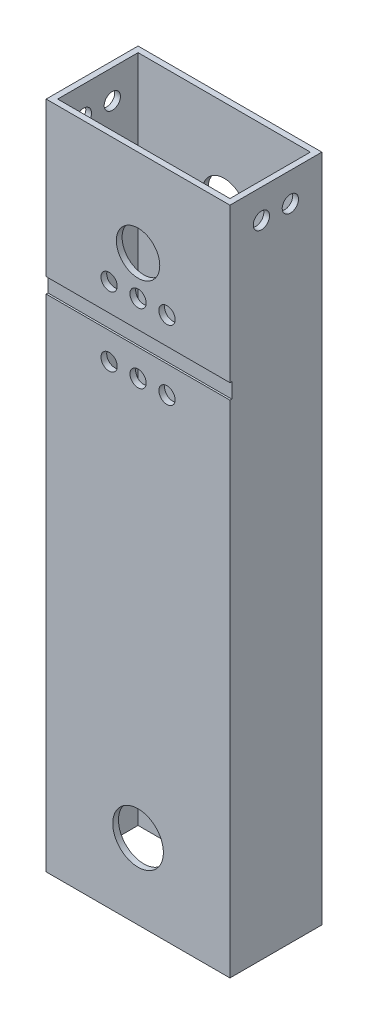
ISO-10303-21;
HEADER;
FILE_DESCRIPTION(('STEP AP214'),'2;1');
FILE_NAME('part.step','',(''),(''),'','','');
FILE_SCHEMA(('AUTOMOTIVE_DESIGN { 1 0 10303 214 1 1 1 1 }'));
ENDSEC;
DATA;
#1=APPLICATION_CONTEXT('core data for automotive mechanical design processes');
#2=APPLICATION_PROTOCOL_DEFINITION('international standard','automotive_design',2000,#1);
#3=PRODUCT_CONTEXT('',#1,'mechanical');
#4=PRODUCT('Part','Part','',(#3));
#5=PRODUCT_RELATED_PRODUCT_CATEGORY('part','',(#4));
#6=PRODUCT_DEFINITION_FORMATION('','',#4);
#7=PRODUCT_DEFINITION_CONTEXT('part definition',#1,'design');
#8=PRODUCT_DEFINITION('design','',#6,#7);
#9=PRODUCT_DEFINITION_SHAPE('','',#8);
#10=(LENGTH_UNIT() NAMED_UNIT(*) SI_UNIT(.MILLI.,.METRE.));
#11=(NAMED_UNIT(*) PLANE_ANGLE_UNIT() SI_UNIT($,.RADIAN.));
#12=(NAMED_UNIT(*) SI_UNIT($,.STERADIAN.) SOLID_ANGLE_UNIT());
#13=UNCERTAINTY_MEASURE_WITH_UNIT(LENGTH_MEASURE(1.E-05),#10,'distance_accuracy_value','');
#14=(GEOMETRIC_REPRESENTATION_CONTEXT(3) GLOBAL_UNCERTAINTY_ASSIGNED_CONTEXT((#13)) GLOBAL_UNIT_ASSIGNED_CONTEXT((#10,
#11,#12)) REPRESENTATION_CONTEXT('',''));
#15=CARTESIAN_POINT('',(0.,0.,0.));
#16=DIRECTION('',(0.,0.,1.));
#17=DIRECTION('',(1.,0.,0.));
#18=AXIS2_PLACEMENT_3D('',#15,#16,#17);
#19=CARTESIAN_POINT('',(25.3999999999999,-20.,-41.));
#20=DIRECTION('',(0.,0.,1.));
#21=DIRECTION('',(1.,0.,0.));
#22=AXIS2_PLACEMENT_3D('',#19,#20,#21);
#23=PLANE('',#22);
#24=DIRECTION('',(-1.,0.,0.));
#25=VECTOR('',#24,1.);
#26=CARTESIAN_POINT('',(-25.4,121.675,-41.));
#27=LINE('',#26,#25);
#28=CARTESIAN_POINT('',(25.4,121.675,-41.));
#29=VERTEX_POINT('',#28);
#30=CARTESIAN_POINT('',(-25.4,121.675,-41.));
#31=VERTEX_POINT('',#30);
#32=EDGE_CURVE('E194',#29,#31,#27,.T.);
#33=ORIENTED_EDGE('',*,*,#32,.F.);
#34=DIRECTION('',(0.,1.,0.));
#35=VECTOR('',#34,1.);
#36=CARTESIAN_POINT('',(25.3999999999999,-20.,-41.));
#37=LINE('',#36,#35);
#38=CARTESIAN_POINT('',(25.3999999999999,164.175,-41.));
#39=VERTEX_POINT('',#38);
#40=EDGE_CURVE('E48',#29,#39,#37,.T.);
#41=ORIENTED_EDGE('',*,*,#40,.T.);
#42=DIRECTION('',(1.,0.,0.));
#43=VECTOR('',#42,1.);
#44=CARTESIAN_POINT('',(25.3999999999999,164.175,-41.));
#45=LINE('',#44,#43);
#46=CARTESIAN_POINT('',(-25.3999999999999,164.175,-41.));
#47=VERTEX_POINT('',#46);
#48=EDGE_CURVE('E300',#47,#39,#45,.T.);
#49=ORIENTED_EDGE('',*,*,#48,.F.);
#50=DIRECTION('',(0.,1.,0.));
#51=VECTOR('',#50,1.);
#52=CARTESIAN_POINT('',(-25.3999999999999,-20.,-41.));
#53=LINE('',#52,#51);
#54=EDGE_CURVE('E311',#31,#47,#53,.T.);
#55=ORIENTED_EDGE('',*,*,#54,.F.);
#56=EDGE_LOOP('',(#33,#41,#49,#55));
#57=FACE_BOUND('',#56,.T.);
#58=CARTESIAN_POINT('',(7.99999999999999,129.175,-41.));
#59=DIRECTION('',(0.,0.,1.));
#60=DIRECTION('',(1.,0.,0.));
#61=AXIS2_PLACEMENT_3D('',#58,#59,#60);
#62=CIRCLE('',#61,2.25);
#63=CARTESIAN_POINT('',(10.25,129.175,-41.));
#64=VERTEX_POINT('',#63);
#65=EDGE_CURVE('E216',#64,#64,#62,.T.);
#66=ORIENTED_EDGE('',*,*,#65,.F.);
#67=EDGE_LOOP('',(#66));
#68=FACE_BOUND('',#67,.T.);
#69=CARTESIAN_POINT('',(0.,129.175,-41.));
#70=DIRECTION('',(0.,0.,1.));
#71=DIRECTION('',(1.,0.,0.));
#72=AXIS2_PLACEMENT_3D('',#69,#70,#71);
#73=CIRCLE('',#72,2.25);
#74=CARTESIAN_POINT('',(2.24999999999999,129.175,-41.));
#75=VERTEX_POINT('',#74);
#76=EDGE_CURVE('E213',#75,#75,#73,.T.);
#77=ORIENTED_EDGE('',*,*,#76,.F.);
#78=EDGE_LOOP('',(#77));
#79=FACE_BOUND('',#78,.T.);
#80=CARTESIAN_POINT('',(-8.00000000000001,129.175,-41.));
#81=DIRECTION('',(0.,0.,1.));
#82=DIRECTION('',(1.,0.,0.));
#83=AXIS2_PLACEMENT_3D('',#80,#81,#82);
#84=CIRCLE('',#83,2.25);
#85=CARTESIAN_POINT('',(-5.75000000000001,129.175,-41.));
#86=VERTEX_POINT('',#85);
#87=EDGE_CURVE('E217',#86,#86,#84,.T.);
#88=ORIENTED_EDGE('',*,*,#87,.F.);
#89=EDGE_LOOP('',(#88));
#90=FACE_BOUND('',#89,.T.);
#91=CARTESIAN_POINT('',(0.,140.,-41.));
#92=DIRECTION('',(0.,0.,1.));
#93=DIRECTION('',(1.,0.,0.));
#94=AXIS2_PLACEMENT_3D('',#91,#92,#93);
#95=CIRCLE('',#94,6.00000000000001);
#96=CARTESIAN_POINT('',(6.,140.,-41.));
#97=VERTEX_POINT('',#96);
#98=EDGE_CURVE('E206',#97,#97,#95,.T.);
#99=ORIENTED_EDGE('',*,*,#98,.F.);
#100=EDGE_LOOP('',(#99));
#101=FACE_BOUND('',#100,.T.);
#102=ADVANCED_FACE('F39',(#57,#68,#79,#90,#101),#23,.T.);
#103=CARTESIAN_POINT('',(25.3999999999999,-20.,-66.4));
#104=DIRECTION('',(1.,0.,0.));
#105=DIRECTION('',(0.,0.,-1.));
#106=AXIS2_PLACEMENT_3D('',#103,#104,#105);
#107=PLANE('',#106);
#108=CARTESIAN_POINT('',(25.3999999999999,156.175,-57.7));
#109=DIRECTION('',(1.,0.,0.));
#110=DIRECTION('',(0.,0.,-1.));
#111=AXIS2_PLACEMENT_3D('',#108,#109,#110);
#112=CIRCLE('',#111,2.25);
#113=CARTESIAN_POINT('',(25.3999999999999,156.175,-59.95));
#114=VERTEX_POINT('',#113);
#115=EDGE_CURVE('E171',#114,#114,#112,.T.);
#116=ORIENTED_EDGE('',*,*,#115,.F.);
#117=EDGE_LOOP('',(#116));
#118=FACE_BOUND('',#117,.T.);
#119=CARTESIAN_POINT('',(25.3999999999999,156.175,-49.7));
#120=DIRECTION('',(1.,0.,0.));
#121=DIRECTION('',(0.,0.,-1.));
#122=AXIS2_PLACEMENT_3D('',#119,#120,#121);
#123=CIRCLE('',#122,2.25);
#124=CARTESIAN_POINT('',(25.3999999999999,156.175,-51.95));
#125=VERTEX_POINT('',#124);
#126=EDGE_CURVE('E170',#125,#125,#123,.T.);
#127=ORIENTED_EDGE('',*,*,#126,.F.);
#128=EDGE_LOOP('',(#127));
#129=FACE_BOUND('',#128,.T.);
#130=DIRECTION('',(0.,0.,1.));
#131=VECTOR('',#130,1.);
#132=CARTESIAN_POINT('',(25.4,121.675,-41.5));
#133=LINE('',#132,#131);
#134=CARTESIAN_POINT('',(25.4,121.675,-41.5));
#135=VERTEX_POINT('',#134);
#136=EDGE_CURVE('E207',#135,#29,#133,.T.);
#137=ORIENTED_EDGE('',*,*,#136,.F.);
#138=DIRECTION('',(0.,1.,0.));
#139=VECTOR('',#138,1.);
#140=CARTESIAN_POINT('',(25.4,121.675,-41.5));
#141=LINE('',#140,#139);
#142=CARTESIAN_POINT('',(25.4,117.5,-41.5));
#143=VERTEX_POINT('',#142);
#144=EDGE_CURVE('E197',#143,#135,#141,.T.);
#145=ORIENTED_EDGE('',*,*,#144,.F.);
#146=DIRECTION('',(0.,0.,1.));
#147=VECTOR('',#146,1.);
#148=CARTESIAN_POINT('',(25.4,117.5,-41.5));
#149=LINE('',#148,#147);
#150=CARTESIAN_POINT('',(25.4,117.5,-41.));
#151=VERTEX_POINT('',#150);
#152=EDGE_CURVE('E209',#143,#151,#149,.T.);
#153=ORIENTED_EDGE('',*,*,#152,.T.);
#154=CARTESIAN_POINT('',(25.3999999999999,-20.82,-41.));
#155=VERTEX_POINT('',#154);
#156=EDGE_CURVE('E11',#155,#151,#37,.T.);
#157=ORIENTED_EDGE('',*,*,#156,.F.);
#158=DIRECTION('',(0.,0.,1.));
#159=VECTOR('',#158,1.);
#160=CARTESIAN_POINT('',(25.3999999999999,-20.82,-66.4));
#161=LINE('',#160,#159);
#162=CARTESIAN_POINT('',(25.3999999999999,-20.82,-66.4));
#163=VERTEX_POINT('',#162);
#164=EDGE_CURVE('E161',#163,#155,#161,.T.);
#165=ORIENTED_EDGE('',*,*,#164,.F.);
#166=DIRECTION('',(0.,1.,0.));
#167=VECTOR('',#166,1.);
#168=CARTESIAN_POINT('',(25.3999999999999,-20.,-66.4));
#169=LINE('',#168,#167);
#170=CARTESIAN_POINT('',(25.3999999999999,164.175,-66.4));
#171=VERTEX_POINT('',#170);
#172=EDGE_CURVE('E304',#163,#171,#169,.T.);
#173=ORIENTED_EDGE('',*,*,#172,.T.);
#174=DIRECTION('',(0.,0.,-1.));
#175=VECTOR('',#174,1.);
#176=CARTESIAN_POINT('',(25.3999999999999,164.175,-66.4));
#177=LINE('',#176,#175);
#178=EDGE_CURVE('E291',#39,#171,#177,.T.);
#179=ORIENTED_EDGE('',*,*,#178,.F.);
#180=ORIENTED_EDGE('',*,*,#40,.F.);
#181=EDGE_LOOP('',(#137,#145,#153,#157,#165,#173,#179,#180));
#182=FACE_BOUND('',#181,.T.);
#183=ADVANCED_FACE('F41',(#118,#129,#182),#107,.T.);
#184=CARTESIAN_POINT('',(0.,0.,-41.));
#185=DIRECTION('',(0.,0.,1.));
#186=DIRECTION('',(1.,0.,0.));
#187=AXIS2_PLACEMENT_3D('',#184,#185,#186);
#188=CIRCLE('',#187,7.);
#189=CARTESIAN_POINT('',(7.,0.,-41.));
#190=VERTEX_POINT('',#189);
#191=EDGE_CURVE('E380',#190,#190,#188,.T.);
#192=ORIENTED_EDGE('',*,*,#191,.F.);
#193=EDGE_LOOP('',(#192));
#194=FACE_BOUND('',#193,.T.);
#195=DIRECTION('',(1.,0.,0.));
#196=VECTOR('',#195,1.);
#197=CARTESIAN_POINT('',(-25.4,117.5,-41.));
#198=LINE('',#197,#196);
#199=CARTESIAN_POINT('',(-25.4,117.5,-41.));
#200=VERTEX_POINT('',#199);
#201=EDGE_CURVE('E190',#200,#151,#198,.T.);
#202=ORIENTED_EDGE('',*,*,#201,.F.);
#203=CARTESIAN_POINT('',(-25.3999999999999,-20.82,-41.));
#204=VERTEX_POINT('',#203);
#205=EDGE_CURVE('E308',#204,#200,#53,.T.);
#206=ORIENTED_EDGE('',*,*,#205,.F.);
#207=DIRECTION('',(-1.,0.,0.));
#208=VECTOR('',#207,1.);
#209=CARTESIAN_POINT('',(25.3999999999999,-20.82,-41.));
#210=LINE('',#209,#208);
#211=EDGE_CURVE('E164',#155,#204,#210,.T.);
#212=ORIENTED_EDGE('',*,*,#211,.F.);
#213=ORIENTED_EDGE('',*,*,#156,.T.);
#214=EDGE_LOOP('',(#202,#206,#212,#213));
#215=FACE_BOUND('',#214,.T.);
#216=CARTESIAN_POINT('',(7.99999999999999,110.,-41.));
#217=DIRECTION('',(0.,0.,1.));
#218=DIRECTION('',(1.,0.,0.));
#219=AXIS2_PLACEMENT_3D('',#216,#217,#218);
#220=CIRCLE('',#219,2.25);
#221=CARTESIAN_POINT('',(10.25,110.,-41.));
#222=VERTEX_POINT('',#221);
#223=EDGE_CURVE('E229',#222,#222,#220,.T.);
#224=ORIENTED_EDGE('',*,*,#223,.F.);
#225=EDGE_LOOP('',(#224));
#226=FACE_BOUND('',#225,.T.);
#227=CARTESIAN_POINT('',(0.,110.,-41.));
#228=DIRECTION('',(0.,0.,1.));
#229=DIRECTION('',(1.,0.,0.));
#230=AXIS2_PLACEMENT_3D('',#227,#228,#229);
#231=CIRCLE('',#230,2.25);
#232=CARTESIAN_POINT('',(2.24999999999999,110.,-41.));
#233=VERTEX_POINT('',#232);
#234=EDGE_CURVE('E226',#233,#233,#231,.T.);
#235=ORIENTED_EDGE('',*,*,#234,.F.);
#236=EDGE_LOOP('',(#235));
#237=FACE_BOUND('',#236,.T.);
#238=CARTESIAN_POINT('',(-8.00000000000001,110.,-41.));
#239=DIRECTION('',(0.,0.,1.));
#240=DIRECTION('',(1.,0.,0.));
#241=AXIS2_PLACEMENT_3D('',#238,#239,#240);
#242=CIRCLE('',#241,2.25);
#243=CARTESIAN_POINT('',(-5.75000000000001,110.,-41.));
#244=VERTEX_POINT('',#243);
#245=EDGE_CURVE('E222',#244,#244,#242,.T.);
#246=ORIENTED_EDGE('',*,*,#245,.F.);
#247=EDGE_LOOP('',(#246));
#248=FACE_BOUND('',#247,.T.);
#249=ADVANCED_FACE('F356',(#194,#215,#226,#237,#248),#23,.T.);
#250=CARTESIAN_POINT('',(-25.3999999999999,-20.,-66.4));
#251=DIRECTION('',(-1.,0.,0.));
#252=DIRECTION('',(0.,0.,1.));
#253=AXIS2_PLACEMENT_3D('',#250,#251,#252);
#254=PLANE('',#253);
#255=CARTESIAN_POINT('',(-25.3999999999999,156.175,-57.7));
#256=DIRECTION('',(-1.,0.,0.));
#257=DIRECTION('',(0.,0.,1.));
#258=AXIS2_PLACEMENT_3D('',#255,#256,#257);
#259=CIRCLE('',#258,2.25);
#260=CARTESIAN_POINT('',(-25.3999999999999,156.175,-55.45));
#261=VERTEX_POINT('',#260);
#262=EDGE_CURVE('E187',#261,#261,#259,.T.);
#263=ORIENTED_EDGE('',*,*,#262,.F.);
#264=EDGE_LOOP('',(#263));
#265=FACE_BOUND('',#264,.T.);
#266=CARTESIAN_POINT('',(-25.3999999999999,156.175,-49.7));
#267=DIRECTION('',(-1.,0.,0.));
#268=DIRECTION('',(0.,0.,1.));
#269=AXIS2_PLACEMENT_3D('',#266,#267,#268);
#270=CIRCLE('',#269,2.25);
#271=CARTESIAN_POINT('',(-25.3999999999999,156.175,-47.45));
#272=VERTEX_POINT('',#271);
#273=EDGE_CURVE('E180',#272,#272,#270,.T.);
#274=ORIENTED_EDGE('',*,*,#273,.F.);
#275=EDGE_LOOP('',(#274));
#276=FACE_BOUND('',#275,.T.);
#277=DIRECTION('',(0.,0.,1.));
#278=VECTOR('',#277,1.);
#279=CARTESIAN_POINT('',(-25.4,121.675,-41.5));
#280=LINE('',#279,#278);
#281=CARTESIAN_POINT('',(-25.3999999999999,121.675,-41.5));
#282=VERTEX_POINT('',#281);
#283=EDGE_CURVE('E203',#282,#31,#280,.T.);
#284=ORIENTED_EDGE('',*,*,#283,.T.);
#285=ORIENTED_EDGE('',*,*,#54,.T.);
#286=DIRECTION('',(0.,0.,1.));
#287=VECTOR('',#286,1.);
#288=CARTESIAN_POINT('',(-25.3999999999999,164.175,-66.4));
#289=LINE('',#288,#287);
#290=CARTESIAN_POINT('',(-25.3999999999999,164.175,-66.4));
#291=VERTEX_POINT('',#290);
#292=EDGE_CURVE('E297',#291,#47,#289,.T.);
#293=ORIENTED_EDGE('',*,*,#292,.F.);
#294=DIRECTION('',(0.,1.,0.));
#295=VECTOR('',#294,1.);
#296=CARTESIAN_POINT('',(-25.3999999999999,-20.,-66.4));
#297=LINE('',#296,#295);
#298=CARTESIAN_POINT('',(-25.3999999999999,-20.82,-66.4));
#299=VERTEX_POINT('',#298);
#300=EDGE_CURVE('E312',#299,#291,#297,.T.);
#301=ORIENTED_EDGE('',*,*,#300,.F.);
#302=DIRECTION('',(0.,0.,-1.));
#303=VECTOR('',#302,1.);
#304=CARTESIAN_POINT('',(-25.3999999999999,-20.82,-41.));
#305=LINE('',#304,#303);
#306=EDGE_CURVE('E167',#204,#299,#305,.T.);
#307=ORIENTED_EDGE('',*,*,#306,.F.);
#308=ORIENTED_EDGE('',*,*,#205,.T.);
#309=DIRECTION('',(0.,0.,1.));
#310=VECTOR('',#309,1.);
#311=CARTESIAN_POINT('',(-25.4,117.5,-41.5));
#312=LINE('',#311,#310);
#313=CARTESIAN_POINT('',(-25.4,117.5,-41.5));
#314=VERTEX_POINT('',#313);
#315=EDGE_CURVE('E200',#314,#200,#312,.T.);
#316=ORIENTED_EDGE('',*,*,#315,.F.);
#317=DIRECTION('',(0.,-1.,0.));
#318=VECTOR('',#317,1.);
#319=CARTESIAN_POINT('',(-25.4,121.675,-41.5));
#320=LINE('',#319,#318);
#321=EDGE_CURVE('E191',#282,#314,#320,.T.);
#322=ORIENTED_EDGE('',*,*,#321,.F.);
#323=EDGE_LOOP('',(#284,#285,#293,#301,#307,#308,#316,#322));
#324=FACE_BOUND('',#323,.T.);
#325=ADVANCED_FACE('F368',(#265,#276,#324),#254,.T.);
#326=CARTESIAN_POINT('',(25.3999999999999,-20.,-66.4));
#327=DIRECTION('',(0.,0.,-1.));
#328=DIRECTION('',(-1.,0.,0.));
#329=AXIS2_PLACEMENT_3D('',#326,#327,#328);
#330=PLANE('',#329);
#331=CARTESIAN_POINT('',(0.,0.,-66.4));
#332=DIRECTION('',(0.,0.,-1.));
#333=DIRECTION('',(-1.,0.,0.));
#334=AXIS2_PLACEMENT_3D('',#331,#332,#333);
#335=CIRCLE('',#334,7.);
#336=CARTESIAN_POINT('',(-7.,0.,-66.4));
#337=VERTEX_POINT('',#336);
#338=EDGE_CURVE('E147',#337,#337,#335,.T.);
#339=ORIENTED_EDGE('',*,*,#338,.F.);
#340=EDGE_LOOP('',(#339));
#341=FACE_BOUND('',#340,.T.);
#342=CARTESIAN_POINT('',(0.,140.,-66.4));
#343=DIRECTION('',(0.,0.,-1.));
#344=DIRECTION('',(-1.,0.,0.));
#345=AXIS2_PLACEMENT_3D('',#342,#343,#344);
#346=CIRCLE('',#345,6.00000000000001);
#347=CARTESIAN_POINT('',(-6.00000000000002,140.,-66.4));
#348=VERTEX_POINT('',#347);
#349=EDGE_CURVE('E279',#348,#348,#346,.T.);
#350=ORIENTED_EDGE('',*,*,#349,.F.);
#351=EDGE_LOOP('',(#350));
#352=FACE_BOUND('',#351,.T.);
#353=CARTESIAN_POINT('',(-8.00000000000001,129.175,-66.4));
#354=DIRECTION('',(0.,0.,-1.));
#355=DIRECTION('',(-1.,0.,0.));
#356=AXIS2_PLACEMENT_3D('',#353,#354,#355);
#357=CIRCLE('',#356,2.25);
#358=CARTESIAN_POINT('',(-10.25,129.175,-66.4));
#359=VERTEX_POINT('',#358);
#360=EDGE_CURVE('E272',#359,#359,#357,.T.);
#361=ORIENTED_EDGE('',*,*,#360,.F.);
#362=EDGE_LOOP('',(#361));
#363=FACE_BOUND('',#362,.T.);
#364=CARTESIAN_POINT('',(0.,129.175,-66.4));
#365=DIRECTION('',(0.,0.,-1.));
#366=DIRECTION('',(-1.,0.,0.));
#367=AXIS2_PLACEMENT_3D('',#364,#365,#366);
#368=CIRCLE('',#367,2.25);
#369=CARTESIAN_POINT('',(-2.25000000000001,129.175,-66.4));
#370=VERTEX_POINT('',#369);
#371=EDGE_CURVE('E265',#370,#370,#368,.T.);
#372=ORIENTED_EDGE('',*,*,#371,.F.);
#373=EDGE_LOOP('',(#372));
#374=FACE_BOUND('',#373,.T.);
#375=CARTESIAN_POINT('',(7.99999999999999,129.175,-66.4));
#376=DIRECTION('',(0.,0.,-1.));
#377=DIRECTION('',(-1.,0.,0.));
#378=AXIS2_PLACEMENT_3D('',#375,#376,#377);
#379=CIRCLE('',#378,2.25);
#380=CARTESIAN_POINT('',(5.74999999999999,129.175,-66.4));
#381=VERTEX_POINT('',#380);
#382=EDGE_CURVE('E258',#381,#381,#379,.T.);
#383=ORIENTED_EDGE('',*,*,#382,.F.);
#384=EDGE_LOOP('',(#383));
#385=FACE_BOUND('',#384,.T.);
#386=CARTESIAN_POINT('',(7.99999999999999,110.,-66.4));
#387=DIRECTION('',(0.,0.,-1.));
#388=DIRECTION('',(-1.,0.,0.));
#389=AXIS2_PLACEMENT_3D('',#386,#387,#388);
#390=CIRCLE('',#389,2.25);
#391=CARTESIAN_POINT('',(5.74999999999999,110.,-66.4));
#392=VERTEX_POINT('',#391);
#393=EDGE_CURVE('E251',#392,#392,#390,.T.);
#394=ORIENTED_EDGE('',*,*,#393,.F.);
#395=EDGE_LOOP('',(#394));
#396=FACE_BOUND('',#395,.T.);
#397=CARTESIAN_POINT('',(0.,110.,-66.4));
#398=DIRECTION('',(0.,0.,-1.));
#399=DIRECTION('',(-1.,0.,0.));
#400=AXIS2_PLACEMENT_3D('',#397,#398,#399);
#401=CIRCLE('',#400,2.25);
#402=CARTESIAN_POINT('',(-2.25000000000001,110.,-66.4));
#403=VERTEX_POINT('',#402);
#404=EDGE_CURVE('E244',#403,#403,#401,.T.);
#405=ORIENTED_EDGE('',*,*,#404,.F.);
#406=EDGE_LOOP('',(#405));
#407=FACE_BOUND('',#406,.T.);
#408=CARTESIAN_POINT('',(-8.00000000000001,110.,-66.4));
#409=DIRECTION('',(0.,0.,-1.));
#410=DIRECTION('',(-1.,0.,0.));
#411=AXIS2_PLACEMENT_3D('',#408,#409,#410);
#412=CIRCLE('',#411,2.25);
#413=CARTESIAN_POINT('',(-10.25,110.,-66.4));
#414=VERTEX_POINT('',#413);
#415=EDGE_CURVE('E237',#414,#414,#412,.T.);
#416=ORIENTED_EDGE('',*,*,#415,.F.);
#417=EDGE_LOOP('',(#416));
#418=FACE_BOUND('',#417,.T.);
#419=ORIENTED_EDGE('',*,*,#300,.T.);
#420=DIRECTION('',(-1.,0.,0.));
#421=VECTOR('',#420,1.);
#422=CARTESIAN_POINT('',(25.3999999999999,164.175,-66.4));
#423=LINE('',#422,#421);
#424=EDGE_CURVE('E294',#171,#291,#423,.T.);
#425=ORIENTED_EDGE('',*,*,#424,.F.);
#426=ORIENTED_EDGE('',*,*,#172,.F.);
#427=DIRECTION('',(1.,0.,0.));
#428=VECTOR('',#427,1.);
#429=CARTESIAN_POINT('',(-25.3999999999999,-20.82,-66.4));
#430=LINE('',#429,#428);
#431=EDGE_CURVE('E158',#299,#163,#430,.T.);
#432=ORIENTED_EDGE('',*,*,#431,.F.);
#433=EDGE_LOOP('',(#419,#425,#426,#432));
#434=FACE_BOUND('',#433,.T.);
#435=ADVANCED_FACE('F375',(#341,#352,#363,#374,#385,#396,#407,#418,#434),#330,.T.);
#436=CARTESIAN_POINT('',(23.8125,-20.,-64.8125));
#437=DIRECTION('',(1.,0.,0.));
#438=DIRECTION('',(0.,0.,-1.));
#439=AXIS2_PLACEMENT_3D('',#436,#437,#438);
#440=PLANE('',#439);
#441=CARTESIAN_POINT('',(23.8125,156.175,-57.7));
#442=DIRECTION('',(1.,0.,0.));
#443=DIRECTION('',(0.,0.,-1.));
#444=AXIS2_PLACEMENT_3D('',#441,#442,#443);
#445=CIRCLE('',#444,2.25);
#446=CARTESIAN_POINT('',(23.8125,156.175,-59.95));
#447=VERTEX_POINT('',#446);
#448=EDGE_CURVE('E184',#447,#447,#445,.T.);
#449=ORIENTED_EDGE('',*,*,#448,.T.);
#450=EDGE_LOOP('',(#449));
#451=FACE_BOUND('',#450,.T.);
#452=CARTESIAN_POINT('',(23.8125,156.175,-49.7));
#453=DIRECTION('',(1.,0.,0.));
#454=DIRECTION('',(0.,0.,-1.));
#455=AXIS2_PLACEMENT_3D('',#452,#453,#454);
#456=CIRCLE('',#455,2.25);
#457=CARTESIAN_POINT('',(23.8125,156.175,-51.95));
#458=VERTEX_POINT('',#457);
#459=EDGE_CURVE('E177',#458,#458,#456,.T.);
#460=ORIENTED_EDGE('',*,*,#459,.T.);
#461=EDGE_LOOP('',(#460));
#462=FACE_BOUND('',#461,.T.);
#463=DIRECTION('',(0.,1.,0.));
#464=VECTOR('',#463,1.);
#465=CARTESIAN_POINT('',(23.8125,-20.,-42.5875));
#466=LINE('',#465,#464);
#467=CARTESIAN_POINT('',(23.8125,-20.82,-42.5875));
#468=VERTEX_POINT('',#467);
#469=CARTESIAN_POINT('',(23.8125,164.175,-42.5875));
#470=VERTEX_POINT('',#469);
#471=EDGE_CURVE('E138',#468,#470,#466,.T.);
#472=ORIENTED_EDGE('',*,*,#471,.T.);
#473=DIRECTION('',(0.,0.,-1.));
#474=VECTOR('',#473,1.);
#475=CARTESIAN_POINT('',(23.8125,164.175,-64.8125));
#476=LINE('',#475,#474);
#477=CARTESIAN_POINT('',(23.8125,164.175,-64.8125));
#478=VERTEX_POINT('',#477);
#479=EDGE_CURVE('E282',#470,#478,#476,.T.);
#480=ORIENTED_EDGE('',*,*,#479,.T.);
#481=DIRECTION('',(0.,1.,0.));
#482=VECTOR('',#481,1.);
#483=CARTESIAN_POINT('',(23.8125,-20.,-64.8125));
#484=LINE('',#483,#482);
#485=CARTESIAN_POINT('',(23.8125,-20.82,-64.8125));
#486=VERTEX_POINT('',#485);
#487=EDGE_CURVE('E303',#486,#478,#484,.T.);
#488=ORIENTED_EDGE('',*,*,#487,.F.);
#489=DIRECTION('',(0.,0.,1.));
#490=VECTOR('',#489,1.);
#491=CARTESIAN_POINT('',(23.8125,-20.82,-42.5875));
#492=LINE('',#491,#490);
#493=EDGE_CURVE('E153',#486,#468,#492,.T.);
#494=ORIENTED_EDGE('',*,*,#493,.T.);
#495=EDGE_LOOP('',(#472,#480,#488,#494));
#496=FACE_BOUND('',#495,.T.);
#497=ADVANCED_FACE('F399',(#451,#462,#496),#440,.F.);
#498=CARTESIAN_POINT('',(23.8125,-20.,-42.5875));
#499=DIRECTION('',(0.,0.,1.));
#500=DIRECTION('',(1.,0.,0.));
#501=AXIS2_PLACEMENT_3D('',#498,#499,#500);
#502=PLANE('',#501);
#503=CARTESIAN_POINT('',(0.,0.,-42.5875));
#504=DIRECTION('',(0.,0.,1.));
#505=DIRECTION('',(1.,0.,0.));
#506=AXIS2_PLACEMENT_3D('',#503,#504,#505);
#507=CIRCLE('',#506,7.);
#508=CARTESIAN_POINT('',(7.,0.,-42.5875));
#509=VERTEX_POINT('',#508);
#510=EDGE_CURVE('E712',#509,#509,#507,.T.);
#511=ORIENTED_EDGE('',*,*,#510,.T.);
#512=EDGE_LOOP('',(#511));
#513=FACE_BOUND('',#512,.T.);
#514=CARTESIAN_POINT('',(0.,140.,-42.5875));
#515=DIRECTION('',(0.,0.,1.));
#516=DIRECTION('',(1.,0.,0.));
#517=AXIS2_PLACEMENT_3D('',#514,#515,#516);
#518=CIRCLE('',#517,6.00000000000001);
#519=CARTESIAN_POINT('',(6.,140.,-42.5875));
#520=VERTEX_POINT('',#519);
#521=EDGE_CURVE('E276',#520,#520,#518,.T.);
#522=ORIENTED_EDGE('',*,*,#521,.T.);
#523=EDGE_LOOP('',(#522));
#524=FACE_BOUND('',#523,.T.);
#525=CARTESIAN_POINT('',(-8.00000000000001,129.175,-42.5875));
#526=DIRECTION('',(0.,0.,1.));
#527=DIRECTION('',(1.,0.,0.));
#528=AXIS2_PLACEMENT_3D('',#525,#526,#527);
#529=CIRCLE('',#528,2.25);
#530=CARTESIAN_POINT('',(-5.75000000000001,129.175,-42.5875));
#531=VERTEX_POINT('',#530);
#532=EDGE_CURVE('E269',#531,#531,#529,.T.);
#533=ORIENTED_EDGE('',*,*,#532,.T.);
#534=EDGE_LOOP('',(#533));
#535=FACE_BOUND('',#534,.T.);
#536=CARTESIAN_POINT('',(0.,129.175,-42.5875));
#537=DIRECTION('',(0.,0.,1.));
#538=DIRECTION('',(1.,0.,0.));
#539=AXIS2_PLACEMENT_3D('',#536,#537,#538);
#540=CIRCLE('',#539,2.25);
#541=CARTESIAN_POINT('',(2.24999999999999,129.175,-42.5875));
#542=VERTEX_POINT('',#541);
#543=EDGE_CURVE('E262',#542,#542,#540,.T.);
#544=ORIENTED_EDGE('',*,*,#543,.T.);
#545=EDGE_LOOP('',(#544));
#546=FACE_BOUND('',#545,.T.);
#547=CARTESIAN_POINT('',(7.99999999999999,129.175,-42.5875));
#548=DIRECTION('',(0.,0.,1.));
#549=DIRECTION('',(1.,0.,0.));
#550=AXIS2_PLACEMENT_3D('',#547,#548,#549);
#551=CIRCLE('',#550,2.25);
#552=CARTESIAN_POINT('',(10.25,129.175,-42.5875));
#553=VERTEX_POINT('',#552);
#554=EDGE_CURVE('E255',#553,#553,#551,.T.);
#555=ORIENTED_EDGE('',*,*,#554,.T.);
#556=EDGE_LOOP('',(#555));
#557=FACE_BOUND('',#556,.T.);
#558=CARTESIAN_POINT('',(7.99999999999999,110.,-42.5875));
#559=DIRECTION('',(0.,0.,1.));
#560=DIRECTION('',(1.,0.,0.));
#561=AXIS2_PLACEMENT_3D('',#558,#559,#560);
#562=CIRCLE('',#561,2.25);
#563=CARTESIAN_POINT('',(10.25,110.,-42.5875));
#564=VERTEX_POINT('',#563);
#565=EDGE_CURVE('E248',#564,#564,#562,.T.);
#566=ORIENTED_EDGE('',*,*,#565,.T.);
#567=EDGE_LOOP('',(#566));
#568=FACE_BOUND('',#567,.T.);
#569=CARTESIAN_POINT('',(0.,110.,-42.5875));
#570=DIRECTION('',(0.,0.,1.));
#571=DIRECTION('',(1.,0.,0.));
#572=AXIS2_PLACEMENT_3D('',#569,#570,#571);
#573=CIRCLE('',#572,2.25);
#574=CARTESIAN_POINT('',(2.24999999999999,110.,-42.5875));
#575=VERTEX_POINT('',#574);
#576=EDGE_CURVE('E241',#575,#575,#573,.T.);
#577=ORIENTED_EDGE('',*,*,#576,.T.);
#578=EDGE_LOOP('',(#577));
#579=FACE_BOUND('',#578,.T.);
#580=CARTESIAN_POINT('',(-8.00000000000001,110.,-42.5875));
#581=DIRECTION('',(0.,0.,1.));
#582=DIRECTION('',(1.,0.,0.));
#583=AXIS2_PLACEMENT_3D('',#580,#581,#582);
#584=CIRCLE('',#583,2.25);
#585=CARTESIAN_POINT('',(-5.75000000000001,110.,-42.5875));
#586=VERTEX_POINT('',#585);
#587=EDGE_CURVE('E234',#586,#586,#584,.T.);
#588=ORIENTED_EDGE('',*,*,#587,.T.);
#589=EDGE_LOOP('',(#588));
#590=FACE_BOUND('',#589,.T.);
#591=DIRECTION('',(0.,1.,0.));
#592=VECTOR('',#591,1.);
#593=CARTESIAN_POINT('',(-23.8125,-20.,-42.5875));
#594=LINE('',#593,#592);
#595=CARTESIAN_POINT('',(-23.8125,-20.82,-42.5875));
#596=VERTEX_POINT('',#595);
#597=CARTESIAN_POINT('',(-23.8125,164.175,-42.5875));
#598=VERTEX_POINT('',#597);
#599=EDGE_CURVE('E64',#596,#598,#594,.T.);
#600=ORIENTED_EDGE('',*,*,#599,.T.);
#601=DIRECTION('',(1.,0.,0.));
#602=VECTOR('',#601,1.);
#603=CARTESIAN_POINT('',(23.8125,164.175,-42.5875));
#604=LINE('',#603,#602);
#605=EDGE_CURVE('E289',#598,#470,#604,.T.);
#606=ORIENTED_EDGE('',*,*,#605,.T.);
#607=ORIENTED_EDGE('',*,*,#471,.F.);
#608=DIRECTION('',(-1.,0.,0.));
#609=VECTOR('',#608,1.);
#610=CARTESIAN_POINT('',(-23.8125,-20.82,-42.5875));
#611=LINE('',#610,#609);
#612=EDGE_CURVE('E142',#468,#596,#611,.T.);
#613=ORIENTED_EDGE('',*,*,#612,.T.);
#614=EDGE_LOOP('',(#600,#606,#607,#613));
#615=FACE_BOUND('',#614,.T.);
#616=ADVANCED_FACE('F143',(#513,#524,#535,#546,#557,#568,#579,#590,#615),#502,.F.);
#617=CARTESIAN_POINT('',(-23.8125,-20.,-64.8125));
#618=DIRECTION('',(-1.,0.,0.));
#619=DIRECTION('',(0.,0.,1.));
#620=AXIS2_PLACEMENT_3D('',#617,#618,#619);
#621=PLANE('',#620);
#622=CARTESIAN_POINT('',(-23.8125,156.175,-57.7));
#623=DIRECTION('',(-1.,0.,0.));
#624=DIRECTION('',(0.,0.,1.));
#625=AXIS2_PLACEMENT_3D('',#622,#623,#624);
#626=CIRCLE('',#625,2.25);
#627=CARTESIAN_POINT('',(-23.8125,156.175,-55.45));
#628=VERTEX_POINT('',#627);
#629=EDGE_CURVE('E183',#628,#628,#626,.T.);
#630=ORIENTED_EDGE('',*,*,#629,.T.);
#631=EDGE_LOOP('',(#630));
#632=FACE_BOUND('',#631,.T.);
#633=CARTESIAN_POINT('',(-23.8125,156.175,-49.7));
#634=DIRECTION('',(-1.,0.,0.));
#635=DIRECTION('',(0.,0.,1.));
#636=AXIS2_PLACEMENT_3D('',#633,#634,#635);
#637=CIRCLE('',#636,2.25);
#638=CARTESIAN_POINT('',(-23.8125,156.175,-47.45));
#639=VERTEX_POINT('',#638);
#640=EDGE_CURVE('E174',#639,#639,#637,.T.);
#641=ORIENTED_EDGE('',*,*,#640,.T.);
#642=EDGE_LOOP('',(#641));
#643=FACE_BOUND('',#642,.T.);
#644=DIRECTION('',(0.,1.,0.));
#645=VECTOR('',#644,1.);
#646=CARTESIAN_POINT('',(-23.8125,-20.,-64.8125));
#647=LINE('',#646,#645);
#648=CARTESIAN_POINT('',(-23.8125,-20.82,-64.8125));
#649=VERTEX_POINT('',#648);
#650=CARTESIAN_POINT('',(-23.8125,164.175,-64.8125));
#651=VERTEX_POINT('',#650);
#652=EDGE_CURVE('E139',#649,#651,#647,.T.);
#653=ORIENTED_EDGE('',*,*,#652,.T.);
#654=DIRECTION('',(0.,0.,1.));
#655=VECTOR('',#654,1.);
#656=CARTESIAN_POINT('',(-23.8125,164.175,-64.8125));
#657=LINE('',#656,#655);
#658=EDGE_CURVE('E136',#651,#598,#657,.T.);
#659=ORIENTED_EDGE('',*,*,#658,.T.);
#660=ORIENTED_EDGE('',*,*,#599,.F.);
#661=DIRECTION('',(0.,0.,-1.));
#662=VECTOR('',#661,1.);
#663=CARTESIAN_POINT('',(-23.8125,-20.82,-64.8125));
#664=LINE('',#663,#662);
#665=EDGE_CURVE('E133',#596,#649,#664,.T.);
#666=ORIENTED_EDGE('',*,*,#665,.T.);
#667=EDGE_LOOP('',(#653,#659,#660,#666));
#668=FACE_BOUND('',#667,.T.);
#669=ADVANCED_FACE('F131',(#632,#643,#668),#621,.F.);
#670=CARTESIAN_POINT('',(23.8125,-20.,-64.8125));
#671=DIRECTION('',(0.,0.,-1.));
#672=DIRECTION('',(-1.,0.,0.));
#673=AXIS2_PLACEMENT_3D('',#670,#671,#672);
#674=PLANE('',#673);
#675=CARTESIAN_POINT('',(0.,0.,-64.8125));
#676=DIRECTION('',(0.,0.,-1.));
#677=DIRECTION('',(-1.,0.,0.));
#678=AXIS2_PLACEMENT_3D('',#675,#676,#677);
#679=CIRCLE('',#678,7.);
#680=CARTESIAN_POINT('',(-7.,0.,-64.8125));
#681=VERTEX_POINT('',#680);
#682=EDGE_CURVE('E43',#681,#681,#679,.T.);
#683=ORIENTED_EDGE('',*,*,#682,.T.);
#684=EDGE_LOOP('',(#683));
#685=FACE_BOUND('',#684,.T.);
#686=CARTESIAN_POINT('',(0.,140.,-64.8125000000001));
#687=DIRECTION('',(0.,0.,-1.));
#688=DIRECTION('',(-1.,0.,0.));
#689=AXIS2_PLACEMENT_3D('',#686,#687,#688);
#690=CIRCLE('',#689,6.00000000000001);
#691=CARTESIAN_POINT('',(-6.00000000000002,140.,-64.8125000000001));
#692=VERTEX_POINT('',#691);
#693=EDGE_CURVE('E275',#692,#692,#690,.T.);
#694=ORIENTED_EDGE('',*,*,#693,.T.);
#695=EDGE_LOOP('',(#694));
#696=FACE_BOUND('',#695,.T.);
#697=CARTESIAN_POINT('',(-8.00000000000001,129.175,-64.8125000000001));
#698=DIRECTION('',(0.,0.,-1.));
#699=DIRECTION('',(-1.,0.,0.));
#700=AXIS2_PLACEMENT_3D('',#697,#698,#699);
#701=CIRCLE('',#700,2.25);
#702=CARTESIAN_POINT('',(-10.25,129.175,-64.8125000000001));
#703=VERTEX_POINT('',#702);
#704=EDGE_CURVE('E268',#703,#703,#701,.T.);
#705=ORIENTED_EDGE('',*,*,#704,.T.);
#706=EDGE_LOOP('',(#705));
#707=FACE_BOUND('',#706,.T.);
#708=CARTESIAN_POINT('',(0.,129.175,-64.8125000000001));
#709=DIRECTION('',(0.,0.,-1.));
#710=DIRECTION('',(-1.,0.,0.));
#711=AXIS2_PLACEMENT_3D('',#708,#709,#710);
#712=CIRCLE('',#711,2.25);
#713=CARTESIAN_POINT('',(-2.25000000000001,129.175,-64.8125000000001));
#714=VERTEX_POINT('',#713);
#715=EDGE_CURVE('E261',#714,#714,#712,.T.);
#716=ORIENTED_EDGE('',*,*,#715,.T.);
#717=EDGE_LOOP('',(#716));
#718=FACE_BOUND('',#717,.T.);
#719=CARTESIAN_POINT('',(7.99999999999999,129.175,-64.8125000000001));
#720=DIRECTION('',(0.,0.,-1.));
#721=DIRECTION('',(-1.,0.,0.));
#722=AXIS2_PLACEMENT_3D('',#719,#720,#721);
#723=CIRCLE('',#722,2.25);
#724=CARTESIAN_POINT('',(5.74999999999999,129.175,-64.8125000000001));
#725=VERTEX_POINT('',#724);
#726=EDGE_CURVE('E254',#725,#725,#723,.T.);
#727=ORIENTED_EDGE('',*,*,#726,.T.);
#728=EDGE_LOOP('',(#727));
#729=FACE_BOUND('',#728,.T.);
#730=CARTESIAN_POINT('',(7.99999999999999,110.,-64.8125000000001));
#731=DIRECTION('',(0.,0.,-1.));
#732=DIRECTION('',(-1.,0.,0.));
#733=AXIS2_PLACEMENT_3D('',#730,#731,#732);
#734=CIRCLE('',#733,2.25);
#735=CARTESIAN_POINT('',(5.74999999999999,110.,-64.8125000000001));
#736=VERTEX_POINT('',#735);
#737=EDGE_CURVE('E247',#736,#736,#734,.T.);
#738=ORIENTED_EDGE('',*,*,#737,.T.);
#739=EDGE_LOOP('',(#738));
#740=FACE_BOUND('',#739,.T.);
#741=CARTESIAN_POINT('',(0.,110.,-64.8125000000001));
#742=DIRECTION('',(0.,0.,-1.));
#743=DIRECTION('',(-1.,0.,0.));
#744=AXIS2_PLACEMENT_3D('',#741,#742,#743);
#745=CIRCLE('',#744,2.25);
#746=CARTESIAN_POINT('',(-2.25000000000001,110.,-64.8125000000001));
#747=VERTEX_POINT('',#746);
#748=EDGE_CURVE('E240',#747,#747,#745,.T.);
#749=ORIENTED_EDGE('',*,*,#748,.T.);
#750=EDGE_LOOP('',(#749));
#751=FACE_BOUND('',#750,.T.);
#752=CARTESIAN_POINT('',(-8.00000000000001,110.,-64.8125000000001));
#753=DIRECTION('',(0.,0.,-1.));
#754=DIRECTION('',(-1.,0.,0.));
#755=AXIS2_PLACEMENT_3D('',#752,#753,#754);
#756=CIRCLE('',#755,2.25);
#757=CARTESIAN_POINT('',(-10.25,110.,-64.8125000000001));
#758=VERTEX_POINT('',#757);
#759=EDGE_CURVE('E225',#758,#758,#756,.T.);
#760=ORIENTED_EDGE('',*,*,#759,.T.);
#761=EDGE_LOOP('',(#760));
#762=FACE_BOUND('',#761,.T.);
#763=ORIENTED_EDGE('',*,*,#487,.T.);
#764=DIRECTION('',(-1.,0.,0.));
#765=VECTOR('',#764,1.);
#766=CARTESIAN_POINT('',(23.8125,164.175,-64.8125));
#767=LINE('',#766,#765);
#768=EDGE_CURVE('E285',#478,#651,#767,.T.);
#769=ORIENTED_EDGE('',*,*,#768,.T.);
#770=ORIENTED_EDGE('',*,*,#652,.F.);
#771=DIRECTION('',(1.,0.,0.));
#772=VECTOR('',#771,1.);
#773=CARTESIAN_POINT('',(23.8125,-20.82,-64.8125));
#774=LINE('',#773,#772);
#775=EDGE_CURVE('E151',#649,#486,#774,.T.);
#776=ORIENTED_EDGE('',*,*,#775,.T.);
#777=EDGE_LOOP('',(#763,#769,#770,#776));
#778=FACE_BOUND('',#777,.T.);
#779=ADVANCED_FACE('F406',(#685,#696,#707,#718,#729,#740,#751,#762,#778),#674,.F.);
#780=CARTESIAN_POINT('',(0.,164.175,0.));
#781=DIRECTION('',(0.,-1.,0.));
#782=DIRECTION('',(0.,0.,-1.));
#783=AXIS2_PLACEMENT_3D('',#780,#781,#782);
#784=PLANE('',#783);
#785=ORIENTED_EDGE('',*,*,#178,.T.);
#786=ORIENTED_EDGE('',*,*,#424,.T.);
#787=ORIENTED_EDGE('',*,*,#292,.T.);
#788=ORIENTED_EDGE('',*,*,#48,.T.);
#789=EDGE_LOOP('',(#785,#786,#787,#788));
#790=FACE_BOUND('',#789,.T.);
#791=ORIENTED_EDGE('',*,*,#479,.F.);
#792=ORIENTED_EDGE('',*,*,#605,.F.);
#793=ORIENTED_EDGE('',*,*,#658,.F.);
#794=ORIENTED_EDGE('',*,*,#768,.F.);
#795=EDGE_LOOP('',(#791,#792,#793,#794));
#796=FACE_BOUND('',#795,.T.);
#797=ADVANCED_FACE('F413',(#790,#796),#784,.F.);
#798=CARTESIAN_POINT('',(-8.00000000000001,110.,-273.));
#799=DIRECTION('',(0.,0.,1.));
#800=DIRECTION('',(1.,0.,0.));
#801=AXIS2_PLACEMENT_3D('',#798,#799,#800);
#802=CYLINDRICAL_SURFACE('',#801,2.25);
#803=ORIENTED_EDGE('',*,*,#415,.T.);
#804=EDGE_LOOP('',(#803));
#805=FACE_BOUND('',#804,.T.);
#806=ORIENTED_EDGE('',*,*,#759,.F.);
#807=EDGE_LOOP('',(#806));
#808=FACE_BOUND('',#807,.T.);
#809=ADVANCED_FACE('F395',(#805,#808),#802,.F.);
#810=CARTESIAN_POINT('',(0.,110.,-273.));
#811=DIRECTION('',(0.,0.,1.));
#812=DIRECTION('',(1.,0.,0.));
#813=AXIS2_PLACEMENT_3D('',#810,#811,#812);
#814=CYLINDRICAL_SURFACE('',#813,2.25);
#815=ORIENTED_EDGE('',*,*,#404,.T.);
#816=EDGE_LOOP('',(#815));
#817=FACE_BOUND('',#816,.T.);
#818=ORIENTED_EDGE('',*,*,#748,.F.);
#819=EDGE_LOOP('',(#818));
#820=FACE_BOUND('',#819,.T.);
#821=ADVANCED_FACE('F445',(#817,#820),#814,.F.);
#822=CARTESIAN_POINT('',(7.99999999999999,110.,-273.));
#823=DIRECTION('',(0.,0.,1.));
#824=DIRECTION('',(1.,0.,0.));
#825=AXIS2_PLACEMENT_3D('',#822,#823,#824);
#826=CYLINDRICAL_SURFACE('',#825,2.25);
#827=ORIENTED_EDGE('',*,*,#393,.T.);
#828=EDGE_LOOP('',(#827));
#829=FACE_BOUND('',#828,.T.);
#830=ORIENTED_EDGE('',*,*,#737,.F.);
#831=EDGE_LOOP('',(#830));
#832=FACE_BOUND('',#831,.T.);
#833=ADVANCED_FACE('F450',(#829,#832),#826,.F.);
#834=CARTESIAN_POINT('',(7.99999999999999,129.175,-273.));
#835=DIRECTION('',(0.,0.,1.));
#836=DIRECTION('',(1.,0.,0.));
#837=AXIS2_PLACEMENT_3D('',#834,#835,#836);
#838=CYLINDRICAL_SURFACE('',#837,2.25);
#839=ORIENTED_EDGE('',*,*,#382,.T.);
#840=EDGE_LOOP('',(#839));
#841=FACE_BOUND('',#840,.T.);
#842=ORIENTED_EDGE('',*,*,#726,.F.);
#843=EDGE_LOOP('',(#842));
#844=FACE_BOUND('',#843,.T.);
#845=ADVANCED_FACE('F466',(#841,#844),#838,.F.);
#846=CARTESIAN_POINT('',(0.,129.175,-273.));
#847=DIRECTION('',(0.,0.,1.));
#848=DIRECTION('',(1.,0.,0.));
#849=AXIS2_PLACEMENT_3D('',#846,#847,#848);
#850=CYLINDRICAL_SURFACE('',#849,2.25);
#851=ORIENTED_EDGE('',*,*,#371,.T.);
#852=EDGE_LOOP('',(#851));
#853=FACE_BOUND('',#852,.T.);
#854=ORIENTED_EDGE('',*,*,#715,.F.);
#855=EDGE_LOOP('',(#854));
#856=FACE_BOUND('',#855,.T.);
#857=ADVANCED_FACE('F473',(#853,#856),#850,.F.);
#858=CARTESIAN_POINT('',(-8.00000000000001,129.175,-273.));
#859=DIRECTION('',(0.,0.,1.));
#860=DIRECTION('',(1.,0.,0.));
#861=AXIS2_PLACEMENT_3D('',#858,#859,#860);
#862=CYLINDRICAL_SURFACE('',#861,2.25);
#863=ORIENTED_EDGE('',*,*,#360,.T.);
#864=EDGE_LOOP('',(#863));
#865=FACE_BOUND('',#864,.T.);
#866=ORIENTED_EDGE('',*,*,#704,.F.);
#867=EDGE_LOOP('',(#866));
#868=FACE_BOUND('',#867,.T.);
#869=ADVANCED_FACE('F481',(#865,#868),#862,.F.);
#870=CARTESIAN_POINT('',(0.,140.,-273.));
#871=DIRECTION('',(0.,0.,1.));
#872=DIRECTION('',(1.,0.,0.));
#873=AXIS2_PLACEMENT_3D('',#870,#871,#872);
#874=CYLINDRICAL_SURFACE('',#873,6.00000000000001);
#875=ORIENTED_EDGE('',*,*,#349,.T.);
#876=EDGE_LOOP('',(#875));
#877=FACE_BOUND('',#876,.T.);
#878=ORIENTED_EDGE('',*,*,#693,.F.);
#879=EDGE_LOOP('',(#878));
#880=FACE_BOUND('',#879,.T.);
#881=ADVANCED_FACE('F393',(#877,#880),#874,.F.);
#882=ORIENTED_EDGE('',*,*,#245,.T.);
#883=EDGE_LOOP('',(#882));
#884=FACE_BOUND('',#883,.T.);
#885=ORIENTED_EDGE('',*,*,#587,.F.);
#886=EDGE_LOOP('',(#885));
#887=FACE_BOUND('',#886,.T.);
#888=ADVANCED_FACE('F389',(#884,#887),#802,.F.);
#889=ORIENTED_EDGE('',*,*,#234,.T.);
#890=EDGE_LOOP('',(#889));
#891=FACE_BOUND('',#890,.T.);
#892=ORIENTED_EDGE('',*,*,#576,.F.);
#893=EDGE_LOOP('',(#892));
#894=FACE_BOUND('',#893,.T.);
#895=ADVANCED_FACE('F392',(#891,#894),#814,.F.);
#896=ORIENTED_EDGE('',*,*,#223,.T.);
#897=EDGE_LOOP('',(#896));
#898=FACE_BOUND('',#897,.T.);
#899=ORIENTED_EDGE('',*,*,#565,.F.);
#900=EDGE_LOOP('',(#899));
#901=FACE_BOUND('',#900,.T.);
#902=ADVANCED_FACE('F458',(#898,#901),#826,.F.);
#903=ORIENTED_EDGE('',*,*,#65,.T.);
#904=EDGE_LOOP('',(#903));
#905=FACE_BOUND('',#904,.T.);
#906=ORIENTED_EDGE('',*,*,#554,.F.);
#907=EDGE_LOOP('',(#906));
#908=FACE_BOUND('',#907,.T.);
#909=ADVANCED_FACE('F461',(#905,#908),#838,.F.);
#910=ORIENTED_EDGE('',*,*,#76,.T.);
#911=EDGE_LOOP('',(#910));
#912=FACE_BOUND('',#911,.T.);
#913=ORIENTED_EDGE('',*,*,#543,.F.);
#914=EDGE_LOOP('',(#913));
#915=FACE_BOUND('',#914,.T.);
#916=ADVANCED_FACE('F464',(#912,#915),#850,.F.);
#917=ORIENTED_EDGE('',*,*,#87,.T.);
#918=EDGE_LOOP('',(#917));
#919=FACE_BOUND('',#918,.T.);
#920=ORIENTED_EDGE('',*,*,#532,.F.);
#921=EDGE_LOOP('',(#920));
#922=FACE_BOUND('',#921,.T.);
#923=ADVANCED_FACE('F470',(#919,#922),#862,.F.);
#924=ORIENTED_EDGE('',*,*,#98,.T.);
#925=EDGE_LOOP('',(#924));
#926=FACE_BOUND('',#925,.T.);
#927=ORIENTED_EDGE('',*,*,#521,.F.);
#928=EDGE_LOOP('',(#927));
#929=FACE_BOUND('',#928,.T.);
#930=ADVANCED_FACE('F454',(#926,#929),#874,.F.);
#931=CARTESIAN_POINT('',(-25.4,121.675,-41.5));
#932=DIRECTION('',(0.,1.,0.));
#933=DIRECTION('',(-1.,0.,0.));
#934=AXIS2_PLACEMENT_3D('',#931,#932,#933);
#935=PLANE('',#934);
#936=ORIENTED_EDGE('',*,*,#32,.T.);
#937=ORIENTED_EDGE('',*,*,#283,.F.);
#938=DIRECTION('',(-1.,0.,0.));
#939=VECTOR('',#938,1.);
#940=CARTESIAN_POINT('',(-25.4,121.675,-41.5));
#941=LINE('',#940,#939);
#942=EDGE_CURVE('E56',#135,#282,#941,.T.);
#943=ORIENTED_EDGE('',*,*,#942,.F.);
#944=ORIENTED_EDGE('',*,*,#136,.T.);
#945=EDGE_LOOP('',(#936,#937,#943,#944));
#946=FACE_BOUND('',#945,.T.);
#947=ADVANCED_FACE('F519',(#946),#935,.F.);
#948=CARTESIAN_POINT('',(-25.4,117.5,-41.5));
#949=DIRECTION('',(0.,-1.,0.));
#950=DIRECTION('',(0.,0.,-1.));
#951=AXIS2_PLACEMENT_3D('',#948,#949,#950);
#952=PLANE('',#951);
#953=ORIENTED_EDGE('',*,*,#201,.T.);
#954=ORIENTED_EDGE('',*,*,#152,.F.);
#955=DIRECTION('',(1.,0.,0.));
#956=VECTOR('',#955,1.);
#957=CARTESIAN_POINT('',(-25.4,117.5,-41.5));
#958=LINE('',#957,#956);
#959=EDGE_CURVE('E193',#314,#143,#958,.T.);
#960=ORIENTED_EDGE('',*,*,#959,.F.);
#961=ORIENTED_EDGE('',*,*,#315,.T.);
#962=EDGE_LOOP('',(#953,#954,#960,#961));
#963=FACE_BOUND('',#962,.T.);
#964=ADVANCED_FACE('F512',(#963),#952,.F.);
#965=CARTESIAN_POINT('',(0.,0.,-41.5));
#966=DIRECTION('',(0.,0.,1.));
#967=DIRECTION('',(1.,0.,0.));
#968=AXIS2_PLACEMENT_3D('',#965,#966,#967);
#969=PLANE('',#968);
#970=ORIENTED_EDGE('',*,*,#321,.T.);
#971=ORIENTED_EDGE('',*,*,#959,.T.);
#972=ORIENTED_EDGE('',*,*,#144,.T.);
#973=ORIENTED_EDGE('',*,*,#942,.T.);
#974=EDGE_LOOP('',(#970,#971,#972,#973));
#975=FACE_BOUND('',#974,.T.);
#976=ADVANCED_FACE('F348',(#975),#969,.T.);
#977=CARTESIAN_POINT('',(-206.6,156.175,-49.7));
#978=DIRECTION('',(1.,0.,0.));
#979=DIRECTION('',(0.,0.,-1.));
#980=AXIS2_PLACEMENT_3D('',#977,#978,#979);
#981=CYLINDRICAL_SURFACE('',#980,2.25);
#982=ORIENTED_EDGE('',*,*,#273,.T.);
#983=EDGE_LOOP('',(#982));
#984=FACE_BOUND('',#983,.T.);
#985=ORIENTED_EDGE('',*,*,#640,.F.);
#986=EDGE_LOOP('',(#985));
#987=FACE_BOUND('',#986,.T.);
#988=ADVANCED_FACE('F338',(#984,#987),#981,.F.);
#989=CARTESIAN_POINT('',(-206.6,156.175,-57.7));
#990=DIRECTION('',(1.,0.,0.));
#991=DIRECTION('',(0.,0.,-1.));
#992=AXIS2_PLACEMENT_3D('',#989,#990,#991);
#993=CYLINDRICAL_SURFACE('',#992,2.25);
#994=ORIENTED_EDGE('',*,*,#262,.T.);
#995=EDGE_LOOP('',(#994));
#996=FACE_BOUND('',#995,.T.);
#997=ORIENTED_EDGE('',*,*,#629,.F.);
#998=EDGE_LOOP('',(#997));
#999=FACE_BOUND('',#998,.T.);
#1000=ADVANCED_FACE('F335',(#996,#999),#993,.F.);
#1001=ORIENTED_EDGE('',*,*,#126,.T.);
#1002=EDGE_LOOP('',(#1001));
#1003=FACE_BOUND('',#1002,.T.);
#1004=ORIENTED_EDGE('',*,*,#459,.F.);
#1005=EDGE_LOOP('',(#1004));
#1006=FACE_BOUND('',#1005,.T.);
#1007=ADVANCED_FACE('F337',(#1003,#1006),#981,.F.);
#1008=ORIENTED_EDGE('',*,*,#115,.T.);
#1009=EDGE_LOOP('',(#1008));
#1010=FACE_BOUND('',#1009,.T.);
#1011=ORIENTED_EDGE('',*,*,#448,.F.);
#1012=EDGE_LOOP('',(#1011));
#1013=FACE_BOUND('',#1012,.T.);
#1014=ADVANCED_FACE('F341',(#1010,#1013),#993,.F.);
#1015=CARTESIAN_POINT('',(0.,-20.82,0.));
#1016=DIRECTION('',(0.,-1.,0.));
#1017=DIRECTION('',(0.,0.,-1.));
#1018=AXIS2_PLACEMENT_3D('',#1015,#1016,#1017);
#1019=PLANE('',#1018);
#1020=ORIENTED_EDGE('',*,*,#431,.T.);
#1021=ORIENTED_EDGE('',*,*,#164,.T.);
#1022=ORIENTED_EDGE('',*,*,#211,.T.);
#1023=ORIENTED_EDGE('',*,*,#306,.T.);
#1024=EDGE_LOOP('',(#1020,#1021,#1022,#1023));
#1025=FACE_BOUND('',#1024,.T.);
#1026=ORIENTED_EDGE('',*,*,#665,.F.);
#1027=ORIENTED_EDGE('',*,*,#612,.F.);
#1028=ORIENTED_EDGE('',*,*,#493,.F.);
#1029=ORIENTED_EDGE('',*,*,#775,.F.);
#1030=EDGE_LOOP('',(#1026,#1027,#1028,#1029));
#1031=FACE_BOUND('',#1030,.T.);
#1032=ADVANCED_FACE('F149',(#1025,#1031),#1019,.T.);
#1033=CARTESIAN_POINT('',(0.,0.,-82.82));
#1034=DIRECTION('',(0.,0.,1.));
#1035=DIRECTION('',(1.,0.,0.));
#1036=AXIS2_PLACEMENT_3D('',#1033,#1034,#1035);
#1037=CYLINDRICAL_SURFACE('',#1036,7.);
#1038=ORIENTED_EDGE('',*,*,#338,.T.);
#1039=EDGE_LOOP('',(#1038));
#1040=FACE_BOUND('',#1039,.T.);
#1041=ORIENTED_EDGE('',*,*,#682,.F.);
#1042=EDGE_LOOP('',(#1041));
#1043=FACE_BOUND('',#1042,.T.);
#1044=ADVANCED_FACE('F691',(#1040,#1043),#1037,.F.);
#1045=ORIENTED_EDGE('',*,*,#191,.T.);
#1046=EDGE_LOOP('',(#1045));
#1047=FACE_BOUND('',#1046,.T.);
#1048=ORIENTED_EDGE('',*,*,#510,.F.);
#1049=EDGE_LOOP('',(#1048));
#1050=FACE_BOUND('',#1049,.T.);
#1051=ADVANCED_FACE('F698',(#1047,#1050),#1037,.F.);
#1052=CLOSED_SHELL('',(#102,#183,#249,#325,#435,#497,#616,#669,#779,#797,#809,#821,#833,#845,
#857,#869,#881,#888,#895,#902,#909,#916,#923,#930,#947,#964,#976,#988,#1000,#1007,#1014,#1032,
#1044,#1051));
#1053=MANIFOLD_SOLID_BREP('B2',#1052);
#1054=ADVANCED_BREP_SHAPE_REPRESENTATION('',(#18,#1053),#14);
#1055=SHAPE_DEFINITION_REPRESENTATION(#9,#1054);
ENDSEC;
END-ISO-10303-21;
